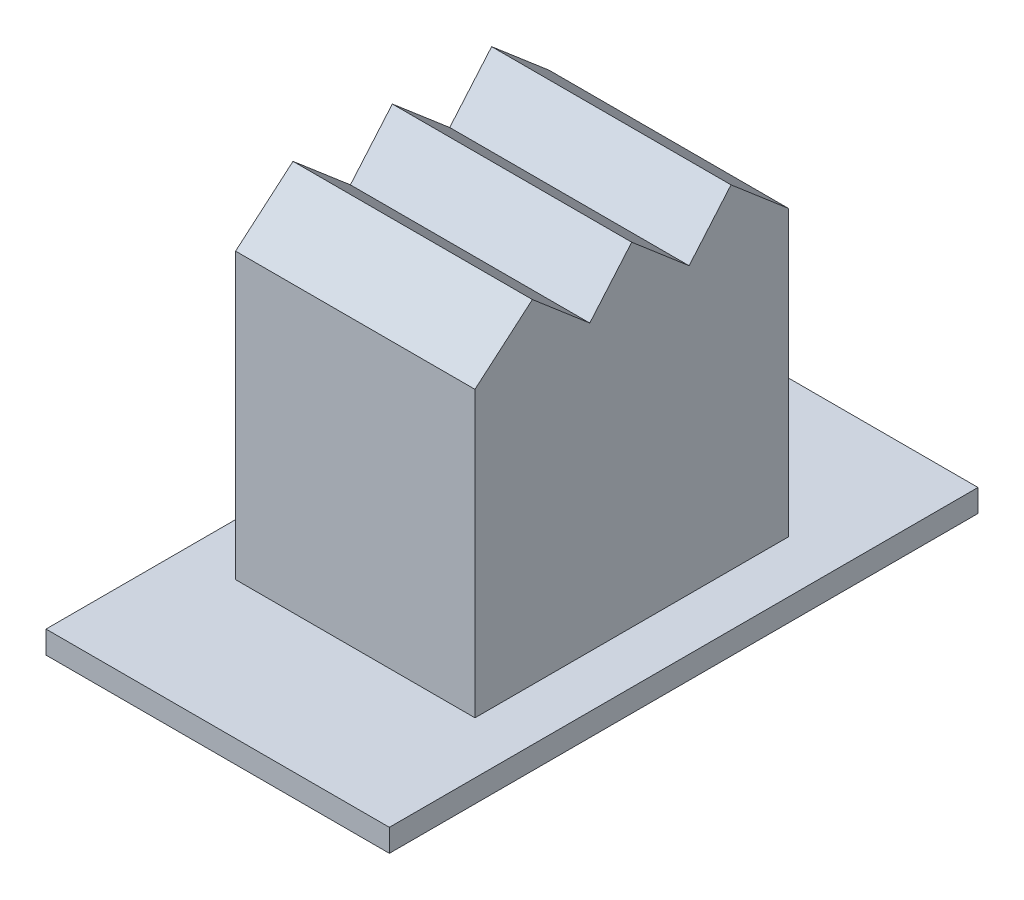
ISO-10303-21;
HEADER;
FILE_DESCRIPTION(('STEP AP214'),'2;1');
FILE_NAME('part.step','',(''),(''),'','','');
FILE_SCHEMA(('AUTOMOTIVE_DESIGN { 1 0 10303 214 1 1 1 1 }'));
ENDSEC;
DATA;
#1=APPLICATION_CONTEXT('core data for automotive mechanical design processes');
#2=APPLICATION_PROTOCOL_DEFINITION('international standard','automotive_design',2000,#1);
#3=PRODUCT_CONTEXT('',#1,'mechanical');
#4=PRODUCT('Part','Part','',(#3));
#5=PRODUCT_RELATED_PRODUCT_CATEGORY('part','',(#4));
#6=PRODUCT_DEFINITION_FORMATION('','',#4);
#7=PRODUCT_DEFINITION_CONTEXT('part definition',#1,'design');
#8=PRODUCT_DEFINITION('design','',#6,#7);
#9=PRODUCT_DEFINITION_SHAPE('','',#8);
#10=(LENGTH_UNIT() NAMED_UNIT(*) SI_UNIT(.MILLI.,.METRE.));
#11=(NAMED_UNIT(*) PLANE_ANGLE_UNIT() SI_UNIT($,.RADIAN.));
#12=(NAMED_UNIT(*) SI_UNIT($,.STERADIAN.) SOLID_ANGLE_UNIT());
#13=UNCERTAINTY_MEASURE_WITH_UNIT(LENGTH_MEASURE(1.E-05),#10,'distance_accuracy_value','');
#14=(GEOMETRIC_REPRESENTATION_CONTEXT(3) GLOBAL_UNCERTAINTY_ASSIGNED_CONTEXT((#13)) GLOBAL_UNIT_ASSIGNED_CONTEXT((#10,
#11,#12)) REPRESENTATION_CONTEXT('',''));
#15=CARTESIAN_POINT('',(0.,0.,0.));
#16=DIRECTION('',(0.,0.,1.));
#17=DIRECTION('',(1.,0.,0.));
#18=AXIS2_PLACEMENT_3D('',#15,#16,#17);
#19=CARTESIAN_POINT('',(0.,0.46,0.));
#20=DIRECTION('',(0.,-1.,0.));
#21=DIRECTION('',(0.,0.,-1.));
#22=AXIS2_PLACEMENT_3D('',#19,#20,#21);
#23=PLANE('',#22);
#24=DIRECTION('',(0.,0.,1.));
#25=VECTOR('',#24,1.);
#26=CARTESIAN_POINT('',(0.,0.46,0.));
#27=LINE('',#26,#25);
#28=CARTESIAN_POINT('',(0.,0.46,-12.));
#29=VERTEX_POINT('',#28);
#30=CARTESIAN_POINT('',(0.,0.46,0.));
#31=VERTEX_POINT('',#30);
#32=EDGE_CURVE('E246',#29,#31,#27,.T.);
#33=ORIENTED_EDGE('',*,*,#32,.T.);
#34=DIRECTION('',(1.,0.,0.));
#35=VECTOR('',#34,1.);
#36=CARTESIAN_POINT('',(0.,0.46,0.));
#37=LINE('',#36,#35);
#38=CARTESIAN_POINT('',(7.,0.46,0.));
#39=VERTEX_POINT('',#38);
#40=EDGE_CURVE('E249',#31,#39,#37,.T.);
#41=ORIENTED_EDGE('',*,*,#40,.T.);
#42=DIRECTION('',(0.,0.,-1.));
#43=VECTOR('',#42,1.);
#44=CARTESIAN_POINT('',(7.,0.46,0.));
#45=LINE('',#44,#43);
#46=CARTESIAN_POINT('',(7.,0.46,-12.));
#47=VERTEX_POINT('',#46);
#48=EDGE_CURVE('E252',#39,#47,#45,.T.);
#49=ORIENTED_EDGE('',*,*,#48,.T.);
#50=DIRECTION('',(-1.,0.,0.));
#51=VECTOR('',#50,1.);
#52=CARTESIAN_POINT('',(0.,0.46,-12.));
#53=LINE('',#52,#51);
#54=EDGE_CURVE('E254',#47,#29,#53,.T.);
#55=ORIENTED_EDGE('',*,*,#54,.T.);
#56=EDGE_LOOP('',(#33,#41,#49,#55));
#57=FACE_BOUND('',#56,.T.);
#58=DIRECTION('',(0.,0.,1.));
#59=VECTOR('',#58,1.);
#60=CARTESIAN_POINT('',(1.06,0.46,-2.805));
#61=LINE('',#60,#59);
#62=CARTESIAN_POINT('',(1.06,0.46,-9.195));
#63=VERTEX_POINT('',#62);
#64=CARTESIAN_POINT('',(1.06,0.46,-2.805));
#65=VERTEX_POINT('',#64);
#66=EDGE_CURVE('E208',#63,#65,#61,.T.);
#67=ORIENTED_EDGE('',*,*,#66,.F.);
#68=DIRECTION('',(-1.,0.,0.));
#69=VECTOR('',#68,1.);
#70=CARTESIAN_POINT('',(1.06,0.46,-9.195));
#71=LINE('',#70,#69);
#72=CARTESIAN_POINT('',(5.94,0.46,-9.195));
#73=VERTEX_POINT('',#72);
#74=EDGE_CURVE('E216',#73,#63,#71,.T.);
#75=ORIENTED_EDGE('',*,*,#74,.F.);
#76=DIRECTION('',(0.,0.,-1.));
#77=VECTOR('',#76,1.);
#78=CARTESIAN_POINT('',(5.94,0.46,-2.805));
#79=LINE('',#78,#77);
#80=CARTESIAN_POINT('',(5.94,0.46,-2.805));
#81=VERTEX_POINT('',#80);
#82=EDGE_CURVE('E213',#81,#73,#79,.T.);
#83=ORIENTED_EDGE('',*,*,#82,.F.);
#84=DIRECTION('',(1.,0.,0.));
#85=VECTOR('',#84,1.);
#86=CARTESIAN_POINT('',(1.06,0.46,-2.805));
#87=LINE('',#86,#85);
#88=EDGE_CURVE('E210',#65,#81,#87,.T.);
#89=ORIENTED_EDGE('',*,*,#88,.F.);
#90=EDGE_LOOP('',(#67,#75,#83,#89));
#91=FACE_BOUND('',#90,.T.);
#92=ADVANCED_FACE('F34',(#57,#91),#23,.F.);
#93=CARTESIAN_POINT('',(0.,0.,0.));
#94=DIRECTION('',(0.,-1.,0.));
#95=DIRECTION('',(0.,0.,-1.));
#96=AXIS2_PLACEMENT_3D('',#93,#94,#95);
#97=PLANE('',#96);
#98=DIRECTION('',(0.,0.,1.));
#99=VECTOR('',#98,1.);
#100=CARTESIAN_POINT('',(0.,0.,0.));
#101=LINE('',#100,#99);
#102=CARTESIAN_POINT('',(0.,0.,-12.));
#103=VERTEX_POINT('',#102);
#104=CARTESIAN_POINT('',(0.,0.,0.));
#105=VERTEX_POINT('',#104);
#106=EDGE_CURVE('E245',#103,#105,#101,.T.);
#107=ORIENTED_EDGE('',*,*,#106,.F.);
#108=DIRECTION('',(-1.,0.,0.));
#109=VECTOR('',#108,1.);
#110=CARTESIAN_POINT('',(0.,0.,-12.));
#111=LINE('',#110,#109);
#112=CARTESIAN_POINT('',(7.,0.,-12.));
#113=VERTEX_POINT('',#112);
#114=EDGE_CURVE('E250',#113,#103,#111,.T.);
#115=ORIENTED_EDGE('',*,*,#114,.F.);
#116=DIRECTION('',(0.,0.,-1.));
#117=VECTOR('',#116,1.);
#118=CARTESIAN_POINT('',(7.,0.,0.));
#119=LINE('',#118,#117);
#120=CARTESIAN_POINT('',(7.,0.,0.));
#121=VERTEX_POINT('',#120);
#122=EDGE_CURVE('E261',#121,#113,#119,.T.);
#123=ORIENTED_EDGE('',*,*,#122,.F.);
#124=DIRECTION('',(1.,0.,0.));
#125=VECTOR('',#124,1.);
#126=CARTESIAN_POINT('',(0.,0.,0.));
#127=LINE('',#126,#125);
#128=EDGE_CURVE('E259',#105,#121,#127,.T.);
#129=ORIENTED_EDGE('',*,*,#128,.F.);
#130=EDGE_LOOP('',(#107,#115,#123,#129));
#131=FACE_BOUND('',#130,.T.);
#132=DIRECTION('',(-1.,0.,0.));
#133=VECTOR('',#132,1.);
#134=CARTESIAN_POINT('',(2.27,0.,-7.185));
#135=LINE('',#134,#133);
#136=CARTESIAN_POINT('',(4.73,0.,-7.185));
#137=VERTEX_POINT('',#136);
#138=CARTESIAN_POINT('',(2.27,0.,-7.185));
#139=VERTEX_POINT('',#138);
#140=EDGE_CURVE('E232',#137,#139,#135,.T.);
#141=ORIENTED_EDGE('',*,*,#140,.T.);
#142=DIRECTION('',(0.,0.,1.));
#143=VECTOR('',#142,1.);
#144=CARTESIAN_POINT('',(2.27,0.,-4.815));
#145=LINE('',#144,#143);
#146=CARTESIAN_POINT('',(2.27,0.,-4.815));
#147=VERTEX_POINT('',#146);
#148=EDGE_CURVE('E223',#139,#147,#145,.T.);
#149=ORIENTED_EDGE('',*,*,#148,.T.);
#150=DIRECTION('',(1.,0.,0.));
#151=VECTOR('',#150,1.);
#152=CARTESIAN_POINT('',(2.27,0.,-4.815));
#153=LINE('',#152,#151);
#154=CARTESIAN_POINT('',(4.73,0.,-4.815));
#155=VERTEX_POINT('',#154);
#156=EDGE_CURVE('E226',#147,#155,#153,.T.);
#157=ORIENTED_EDGE('',*,*,#156,.T.);
#158=DIRECTION('',(0.,0.,-1.));
#159=VECTOR('',#158,1.);
#160=CARTESIAN_POINT('',(4.73,0.,-4.815));
#161=LINE('',#160,#159);
#162=EDGE_CURVE('E229',#155,#137,#161,.T.);
#163=ORIENTED_EDGE('',*,*,#162,.T.);
#164=EDGE_LOOP('',(#141,#149,#157,#163));
#165=FACE_BOUND('',#164,.T.);
#166=ADVANCED_FACE('F320',(#131,#165),#97,.T.);
#167=CARTESIAN_POINT('',(0.,0.46,0.));
#168=DIRECTION('',(1.,0.,0.));
#169=DIRECTION('',(0.,0.,-1.));
#170=AXIS2_PLACEMENT_3D('',#167,#168,#169);
#171=PLANE('',#170);
#172=ORIENTED_EDGE('',*,*,#106,.T.);
#173=DIRECTION('',(0.,-1.,0.));
#174=VECTOR('',#173,1.);
#175=CARTESIAN_POINT('',(0.,0.46,0.));
#176=LINE('',#175,#174);
#177=EDGE_CURVE('E165',#31,#105,#176,.T.);
#178=ORIENTED_EDGE('',*,*,#177,.F.);
#179=ORIENTED_EDGE('',*,*,#32,.F.);
#180=DIRECTION('',(0.,-1.,0.));
#181=VECTOR('',#180,1.);
#182=CARTESIAN_POINT('',(0.,0.46,-12.));
#183=LINE('',#182,#181);
#184=EDGE_CURVE('E256',#29,#103,#183,.T.);
#185=ORIENTED_EDGE('',*,*,#184,.T.);
#186=EDGE_LOOP('',(#172,#178,#179,#185));
#187=FACE_BOUND('',#186,.T.);
#188=ADVANCED_FACE('F36',(#187),#171,.F.);
#189=CARTESIAN_POINT('',(0.,0.46,0.));
#190=DIRECTION('',(0.,0.,-1.));
#191=DIRECTION('',(-1.,0.,0.));
#192=AXIS2_PLACEMENT_3D('',#189,#190,#191);
#193=PLANE('',#192);
#194=ORIENTED_EDGE('',*,*,#128,.T.);
#195=DIRECTION('',(0.,-1.,0.));
#196=VECTOR('',#195,1.);
#197=CARTESIAN_POINT('',(7.,0.46,0.));
#198=LINE('',#197,#196);
#199=EDGE_CURVE('E269',#39,#121,#198,.T.);
#200=ORIENTED_EDGE('',*,*,#199,.F.);
#201=ORIENTED_EDGE('',*,*,#40,.F.);
#202=ORIENTED_EDGE('',*,*,#177,.T.);
#203=EDGE_LOOP('',(#194,#200,#201,#202));
#204=FACE_BOUND('',#203,.T.);
#205=ADVANCED_FACE('F338',(#204),#193,.F.);
#206=CARTESIAN_POINT('',(7.,0.46,0.));
#207=DIRECTION('',(-1.,0.,0.));
#208=DIRECTION('',(0.,0.,1.));
#209=AXIS2_PLACEMENT_3D('',#206,#207,#208);
#210=PLANE('',#209);
#211=ORIENTED_EDGE('',*,*,#122,.T.);
#212=DIRECTION('',(0.,-1.,0.));
#213=VECTOR('',#212,1.);
#214=CARTESIAN_POINT('',(7.,0.46,-12.));
#215=LINE('',#214,#213);
#216=EDGE_CURVE('E266',#47,#113,#215,.T.);
#217=ORIENTED_EDGE('',*,*,#216,.F.);
#218=ORIENTED_EDGE('',*,*,#48,.F.);
#219=ORIENTED_EDGE('',*,*,#199,.T.);
#220=EDGE_LOOP('',(#211,#217,#218,#219));
#221=FACE_BOUND('',#220,.T.);
#222=ADVANCED_FACE('F335',(#221),#210,.F.);
#223=CARTESIAN_POINT('',(0.,0.46,-12.));
#224=DIRECTION('',(0.,0.,1.));
#225=DIRECTION('',(1.,0.,0.));
#226=AXIS2_PLACEMENT_3D('',#223,#224,#225);
#227=PLANE('',#226);
#228=ORIENTED_EDGE('',*,*,#114,.T.);
#229=ORIENTED_EDGE('',*,*,#184,.F.);
#230=ORIENTED_EDGE('',*,*,#54,.F.);
#231=ORIENTED_EDGE('',*,*,#216,.T.);
#232=EDGE_LOOP('',(#228,#229,#230,#231));
#233=FACE_BOUND('',#232,.T.);
#234=ADVANCED_FACE('F332',(#233),#227,.F.);
#235=CARTESIAN_POINT('',(2.27,0.46,-4.815));
#236=DIRECTION('',(1.,0.,0.));
#237=DIRECTION('',(0.,0.,-1.));
#238=AXIS2_PLACEMENT_3D('',#235,#236,#237);
#239=PLANE('',#238);
#240=ORIENTED_EDGE('',*,*,#148,.F.);
#241=DIRECTION('',(0.,-1.,0.));
#242=VECTOR('',#241,1.);
#243=CARTESIAN_POINT('',(2.27,0.46,-7.185));
#244=LINE('',#243,#242);
#245=CARTESIAN_POINT('',(2.27,4.46,-7.185));
#246=VERTEX_POINT('',#245);
#247=EDGE_CURVE('E235',#246,#139,#244,.T.);
#248=ORIENTED_EDGE('',*,*,#247,.F.);
#249=DIRECTION('',(0.,0.,1.));
#250=VECTOR('',#249,1.);
#251=CARTESIAN_POINT('',(2.27,4.46,-7.185));
#252=LINE('',#251,#250);
#253=CARTESIAN_POINT('',(2.27,4.46,-4.815));
#254=VERTEX_POINT('',#253);
#255=EDGE_CURVE('E196',#246,#254,#252,.T.);
#256=ORIENTED_EDGE('',*,*,#255,.T.);
#257=DIRECTION('',(0.,-1.,0.));
#258=VECTOR('',#257,1.);
#259=CARTESIAN_POINT('',(2.27,0.46,-4.815));
#260=LINE('',#259,#258);
#261=EDGE_CURVE('E242',#254,#147,#260,.T.);
#262=ORIENTED_EDGE('',*,*,#261,.T.);
#263=EDGE_LOOP('',(#240,#248,#256,#262));
#264=FACE_BOUND('',#263,.T.);
#265=ADVANCED_FACE('F329',(#264),#239,.T.);
#266=CARTESIAN_POINT('',(2.27,0.46,-4.815));
#267=DIRECTION('',(0.,0.,-1.));
#268=DIRECTION('',(-1.,0.,0.));
#269=AXIS2_PLACEMENT_3D('',#266,#267,#268);
#270=PLANE('',#269);
#271=ORIENTED_EDGE('',*,*,#156,.F.);
#272=ORIENTED_EDGE('',*,*,#261,.F.);
#273=DIRECTION('',(1.,0.,0.));
#274=VECTOR('',#273,1.);
#275=CARTESIAN_POINT('',(2.27,4.46,-4.815));
#276=LINE('',#275,#274);
#277=CARTESIAN_POINT('',(4.73,4.46,-4.815));
#278=VERTEX_POINT('',#277);
#279=EDGE_CURVE('E199',#254,#278,#276,.T.);
#280=ORIENTED_EDGE('',*,*,#279,.T.);
#281=DIRECTION('',(0.,-1.,0.));
#282=VECTOR('',#281,1.);
#283=CARTESIAN_POINT('',(4.73,0.46,-4.815));
#284=LINE('',#283,#282);
#285=EDGE_CURVE('E240',#278,#155,#284,.T.);
#286=ORIENTED_EDGE('',*,*,#285,.T.);
#287=EDGE_LOOP('',(#271,#272,#280,#286));
#288=FACE_BOUND('',#287,.T.);
#289=ADVANCED_FACE('F365',(#288),#270,.T.);
#290=CARTESIAN_POINT('',(4.73,0.46,-4.815));
#291=DIRECTION('',(-1.,0.,0.));
#292=DIRECTION('',(0.,0.,1.));
#293=AXIS2_PLACEMENT_3D('',#290,#291,#292);
#294=PLANE('',#293);
#295=ORIENTED_EDGE('',*,*,#162,.F.);
#296=ORIENTED_EDGE('',*,*,#285,.F.);
#297=DIRECTION('',(0.,0.,-1.));
#298=VECTOR('',#297,1.);
#299=CARTESIAN_POINT('',(4.73,4.46,-7.185));
#300=LINE('',#299,#298);
#301=CARTESIAN_POINT('',(4.73,4.46,-7.185));
#302=VERTEX_POINT('',#301);
#303=EDGE_CURVE('E202',#278,#302,#300,.T.);
#304=ORIENTED_EDGE('',*,*,#303,.T.);
#305=DIRECTION('',(0.,-1.,0.));
#306=VECTOR('',#305,1.);
#307=CARTESIAN_POINT('',(4.73,0.46,-7.185));
#308=LINE('',#307,#306);
#309=EDGE_CURVE('E238',#302,#137,#308,.T.);
#310=ORIENTED_EDGE('',*,*,#309,.T.);
#311=EDGE_LOOP('',(#295,#296,#304,#310));
#312=FACE_BOUND('',#311,.T.);
#313=ADVANCED_FACE('F368',(#312),#294,.T.);
#314=CARTESIAN_POINT('',(2.27,0.46,-7.185));
#315=DIRECTION('',(0.,0.,1.));
#316=DIRECTION('',(1.,0.,0.));
#317=AXIS2_PLACEMENT_3D('',#314,#315,#316);
#318=PLANE('',#317);
#319=ORIENTED_EDGE('',*,*,#140,.F.);
#320=ORIENTED_EDGE('',*,*,#309,.F.);
#321=DIRECTION('',(-1.,0.,0.));
#322=VECTOR('',#321,1.);
#323=CARTESIAN_POINT('',(2.27,4.46,-7.185));
#324=LINE('',#323,#322);
#325=EDGE_CURVE('E205',#302,#246,#324,.T.);
#326=ORIENTED_EDGE('',*,*,#325,.T.);
#327=ORIENTED_EDGE('',*,*,#247,.T.);
#328=EDGE_LOOP('',(#319,#320,#326,#327));
#329=FACE_BOUND('',#328,.T.);
#330=ADVANCED_FACE('F317',(#329),#318,.T.);
#331=CARTESIAN_POINT('',(1.06,4.46,-2.805));
#332=DIRECTION('',(1.,0.,0.));
#333=DIRECTION('',(0.,0.,-1.));
#334=AXIS2_PLACEMENT_3D('',#331,#332,#333);
#335=PLANE('',#334);
#336=DIRECTION('',(0.,-1.,0.));
#337=VECTOR('',#336,1.);
#338=CARTESIAN_POINT('',(1.06,4.46,-2.805));
#339=LINE('',#338,#337);
#340=CARTESIAN_POINT('',(1.06,6.26,-2.805));
#341=VERTEX_POINT('',#340);
#342=EDGE_CURVE('E172',#341,#65,#339,.T.);
#343=ORIENTED_EDGE('',*,*,#342,.F.);
#344=DIRECTION('',(0.,-0.649644996271411,0.760237712047698));
#345=VECTOR('',#344,1.);
#346=CARTESIAN_POINT('',(1.06,2.23269185657802,1.90789942389866));
#347=LINE('',#346,#345);
#348=CARTESIAN_POINT('',(1.06,7.26,-3.97523561546848));
#349=VERTEX_POINT('',#348);
#350=EDGE_CURVE('E158',#349,#341,#347,.T.);
#351=ORIENTED_EDGE('',*,*,#350,.F.);
#352=DIRECTION('',(0.,0.649644996271411,0.760237712047698));
#353=VECTOR('',#352,1.);
#354=CARTESIAN_POINT('',(1.06,6.15930736388138,-5.26330533993839));
#355=LINE('',#354,#353);
#356=CARTESIAN_POINT('',(1.06,6.26,-5.14547123093697));
#357=VERTEX_POINT('',#356);
#358=EDGE_CURVE('E171',#357,#349,#355,.T.);
#359=ORIENTED_EDGE('',*,*,#358,.F.);
#360=DIRECTION('',(0.,-0.760237712047698,0.649644996271411));
#361=VECTOR('',#360,1.);
#362=CARTESIAN_POINT('',(1.06,0.100692636118622,0.11783410900142));
#363=LINE('',#362,#361);
#364=CARTESIAN_POINT('',(1.06,7.26,-6.));
#365=VERTEX_POINT('',#364);
#366=EDGE_CURVE('E179',#365,#357,#363,.T.);
#367=ORIENTED_EDGE('',*,*,#366,.F.);
#368=DIRECTION('',(0.,0.649644996271412,0.760237712047697));
#369=VECTOR('',#368,1.);
#370=CARTESIAN_POINT('',(1.06,7.15930736388137,-6.11783410900142));
#371=LINE('',#370,#369);
#372=CARTESIAN_POINT('',(1.06,6.26,-7.17023561546849));
#373=VERTEX_POINT('',#372);
#374=EDGE_CURVE('E279',#373,#365,#371,.T.);
#375=ORIENTED_EDGE('',*,*,#374,.F.);
#376=DIRECTION('',(0.,-0.760237712047697,0.649644996271412));
#377=VECTOR('',#376,1.);
#378=CARTESIAN_POINT('',(1.06,-0.899307363881372,-1.05240150646706));
#379=LINE('',#378,#377);
#380=CARTESIAN_POINT('',(1.06,7.26,-8.02476438453151));
#381=VERTEX_POINT('',#380);
#382=EDGE_CURVE('E290',#381,#373,#379,.T.);
#383=ORIENTED_EDGE('',*,*,#382,.F.);
#384=DIRECTION('',(0.,0.649644996271412,0.760237712047697));
#385=VECTOR('',#384,1.);
#386=CARTESIAN_POINT('',(1.06,8.15930736388137,-6.97236287806445));
#387=LINE('',#386,#385);
#388=CARTESIAN_POINT('',(1.06,6.26,-9.195));
#389=VERTEX_POINT('',#388);
#390=EDGE_CURVE('E181',#389,#381,#387,.T.);
#391=ORIENTED_EDGE('',*,*,#390,.F.);
#392=DIRECTION('',(0.,-1.,0.));
#393=VECTOR('',#392,1.);
#394=CARTESIAN_POINT('',(1.06,4.46,-9.195));
#395=LINE('',#394,#393);
#396=EDGE_CURVE('E49',#389,#63,#395,.T.);
#397=ORIENTED_EDGE('',*,*,#396,.T.);
#398=ORIENTED_EDGE('',*,*,#66,.T.);
#399=EDGE_LOOP('',(#343,#351,#359,#367,#375,#383,#391,#397,#398));
#400=FACE_BOUND('',#399,.T.);
#401=ADVANCED_FACE('F169',(#400),#335,.F.);
#402=CARTESIAN_POINT('',(1.06,4.46,-2.805));
#403=DIRECTION('',(0.,0.,-1.));
#404=DIRECTION('',(-1.,0.,0.));
#405=AXIS2_PLACEMENT_3D('',#402,#403,#404);
#406=PLANE('',#405);
#407=DIRECTION('',(0.,-1.,0.));
#408=VECTOR('',#407,1.);
#409=CARTESIAN_POINT('',(5.94,4.46,-2.805));
#410=LINE('',#409,#408);
#411=CARTESIAN_POINT('',(5.94,6.26,-2.805));
#412=VERTEX_POINT('',#411);
#413=EDGE_CURVE('E220',#412,#81,#410,.T.);
#414=ORIENTED_EDGE('',*,*,#413,.F.);
#415=DIRECTION('',(-1.,0.,0.));
#416=VECTOR('',#415,1.);
#417=CARTESIAN_POINT('',(11.06,6.26,-2.805));
#418=LINE('',#417,#416);
#419=EDGE_CURVE('E173',#412,#341,#418,.T.);
#420=ORIENTED_EDGE('',*,*,#419,.T.);
#421=ORIENTED_EDGE('',*,*,#342,.T.);
#422=ORIENTED_EDGE('',*,*,#88,.T.);
#423=EDGE_LOOP('',(#414,#420,#421,#422));
#424=FACE_BOUND('',#423,.T.);
#425=ADVANCED_FACE('F308',(#424),#406,.F.);
#426=CARTESIAN_POINT('',(5.94,4.46,-2.805));
#427=DIRECTION('',(-1.,0.,0.));
#428=DIRECTION('',(0.,0.,1.));
#429=AXIS2_PLACEMENT_3D('',#426,#427,#428);
#430=PLANE('',#429);
#431=DIRECTION('',(0.,0.649644996271411,0.760237712047698));
#432=VECTOR('',#431,1.);
#433=CARTESIAN_POINT('',(5.94,6.65625323951417,-4.68176157731273));
#434=LINE('',#433,#432);
#435=CARTESIAN_POINT('',(5.94,6.26,-5.14547123093697));
#436=VERTEX_POINT('',#435);
#437=CARTESIAN_POINT('',(5.94,7.26,-3.97523561546848));
#438=VERTEX_POINT('',#437);
#439=EDGE_CURVE('E187',#436,#438,#434,.T.);
#440=ORIENTED_EDGE('',*,*,#439,.T.);
#441=DIRECTION('',(0.,-0.649644996271411,0.760237712047698));
#442=VECTOR('',#441,1.);
#443=CARTESIAN_POINT('',(5.94,5.50033048187513,-1.9160076739045));
#444=LINE('',#443,#442);
#445=EDGE_CURVE('E161',#438,#412,#444,.T.);
#446=ORIENTED_EDGE('',*,*,#445,.T.);
#447=ORIENTED_EDGE('',*,*,#413,.T.);
#448=ORIENTED_EDGE('',*,*,#82,.T.);
#449=DIRECTION('',(0.,-1.,0.));
#450=VECTOR('',#449,1.);
#451=CARTESIAN_POINT('',(5.94,4.46,-9.195));
#452=LINE('',#451,#450);
#453=CARTESIAN_POINT('',(5.94,6.26,-9.195));
#454=VERTEX_POINT('',#453);
#455=EDGE_CURVE('E57',#454,#73,#452,.T.);
#456=ORIENTED_EDGE('',*,*,#455,.F.);
#457=DIRECTION('',(0.,0.649644996271412,0.760237712047697));
#458=VECTOR('',#457,1.);
#459=CARTESIAN_POINT('',(5.94,8.65625323951417,-6.39081911543879));
#460=LINE('',#459,#458);
#461=CARTESIAN_POINT('',(5.94,7.26,-8.02476438453151));
#462=VERTEX_POINT('',#461);
#463=EDGE_CURVE('E193',#454,#462,#460,.T.);
#464=ORIENTED_EDGE('',*,*,#463,.T.);
#465=DIRECTION('',(0.,-0.760237712047697,0.649644996271412));
#466=VECTOR('',#465,1.);
#467=CARTESIAN_POINT('',(5.94,3.06374676048583,-4.43894526909273));
#468=LINE('',#467,#466);
#469=CARTESIAN_POINT('',(5.94,6.26,-7.17023561546849));
#470=VERTEX_POINT('',#469);
#471=EDGE_CURVE('E285',#462,#470,#468,.T.);
#472=ORIENTED_EDGE('',*,*,#471,.T.);
#473=DIRECTION('',(0.,0.649644996271412,0.760237712047697));
#474=VECTOR('',#473,1.);
#475=CARTESIAN_POINT('',(5.94,7.65625323951417,-5.53629034637576));
#476=LINE('',#475,#474);
#477=CARTESIAN_POINT('',(5.94,7.26,-6.));
#478=VERTEX_POINT('',#477);
#479=EDGE_CURVE('E183',#470,#478,#476,.T.);
#480=ORIENTED_EDGE('',*,*,#479,.T.);
#481=DIRECTION('',(0.,-0.760237712047698,0.649644996271411));
#482=VECTOR('',#481,1.);
#483=CARTESIAN_POINT('',(5.94,4.06374676048583,-3.26870965362424));
#484=LINE('',#483,#482);
#485=EDGE_CURVE('E189',#478,#436,#484,.T.);
#486=ORIENTED_EDGE('',*,*,#485,.T.);
#487=EDGE_LOOP('',(#440,#446,#447,#448,#456,#464,#472,#480,#486));
#488=FACE_BOUND('',#487,.T.);
#489=ADVANCED_FACE('F284',(#488),#430,.F.);
#490=CARTESIAN_POINT('',(1.06,4.46,-9.195));
#491=DIRECTION('',(0.,0.,1.));
#492=DIRECTION('',(1.,0.,0.));
#493=AXIS2_PLACEMENT_3D('',#490,#491,#492);
#494=PLANE('',#493);
#495=ORIENTED_EDGE('',*,*,#396,.F.);
#496=DIRECTION('',(-1.,0.,0.));
#497=VECTOR('',#496,1.);
#498=CARTESIAN_POINT('',(11.06,6.26,-9.195));
#499=LINE('',#498,#497);
#500=EDGE_CURVE('E190',#454,#389,#499,.T.);
#501=ORIENTED_EDGE('',*,*,#500,.F.);
#502=ORIENTED_EDGE('',*,*,#455,.T.);
#503=ORIENTED_EDGE('',*,*,#74,.T.);
#504=EDGE_LOOP('',(#495,#501,#502,#503));
#505=FACE_BOUND('',#504,.T.);
#506=ADVANCED_FACE('F302',(#505),#494,.F.);
#507=CARTESIAN_POINT('',(0.,4.46,0.));
#508=DIRECTION('',(0.,-1.,0.));
#509=DIRECTION('',(0.,0.,-1.));
#510=AXIS2_PLACEMENT_3D('',#507,#508,#509);
#511=PLANE('',#510);
#512=ORIENTED_EDGE('',*,*,#255,.F.);
#513=ORIENTED_EDGE('',*,*,#325,.F.);
#514=ORIENTED_EDGE('',*,*,#303,.F.);
#515=ORIENTED_EDGE('',*,*,#279,.F.);
#516=EDGE_LOOP('',(#512,#513,#514,#515));
#517=FACE_BOUND('',#516,.T.);
#518=ADVANCED_FACE('F370',(#517),#511,.T.);
#519=CARTESIAN_POINT('',(11.06,0.100692636118622,0.11783410900142));
#520=DIRECTION('',(0.,-0.649644996271411,-0.760237712047698));
#521=DIRECTION('',(0.,0.760237712047698,-0.649644996271411));
#522=AXIS2_PLACEMENT_3D('',#519,#520,#521);
#523=PLANE('',#522);
#524=DIRECTION('',(1.,0.,0.));
#525=VECTOR('',#524,1.);
#526=CARTESIAN_POINT('',(0.,7.26,-6.));
#527=LINE('',#526,#525);
#528=EDGE_CURVE('E42',#365,#478,#527,.T.);
#529=ORIENTED_EDGE('',*,*,#528,.F.);
#530=ORIENTED_EDGE('',*,*,#366,.T.);
#531=DIRECTION('',(-1.,0.,0.));
#532=VECTOR('',#531,1.);
#533=CARTESIAN_POINT('',(11.06,6.26,-5.14547123093697));
#534=LINE('',#533,#532);
#535=EDGE_CURVE('E177',#436,#357,#534,.T.);
#536=ORIENTED_EDGE('',*,*,#535,.F.);
#537=ORIENTED_EDGE('',*,*,#485,.F.);
#538=EDGE_LOOP('',(#529,#530,#536,#537));
#539=FACE_BOUND('',#538,.T.);
#540=ADVANCED_FACE('F287',(#539),#523,.F.);
#541=CARTESIAN_POINT('',(11.06,6.15930736388138,-5.26330533993839));
#542=DIRECTION('',(0.,-0.760237712047698,0.649644996271411));
#543=DIRECTION('',(0.,-0.649644996271411,-0.760237712047698));
#544=AXIS2_PLACEMENT_3D('',#541,#542,#543);
#545=PLANE('',#544);
#546=ORIENTED_EDGE('',*,*,#535,.T.);
#547=ORIENTED_EDGE('',*,*,#358,.T.);
#548=DIRECTION('',(-1.,0.,0.));
#549=VECTOR('',#548,1.);
#550=CARTESIAN_POINT('',(0.,7.26,-3.97523561546849));
#551=LINE('',#550,#549);
#552=EDGE_CURVE('E155',#438,#349,#551,.T.);
#553=ORIENTED_EDGE('',*,*,#552,.F.);
#554=ORIENTED_EDGE('',*,*,#439,.F.);
#555=EDGE_LOOP('',(#546,#547,#553,#554));
#556=FACE_BOUND('',#555,.T.);
#557=ADVANCED_FACE('F175',(#556),#545,.F.);
#558=CARTESIAN_POINT('',(11.06,8.15930736388137,-6.97236287806445));
#559=DIRECTION('',(0.,-0.760237712047697,0.649644996271412));
#560=DIRECTION('',(0.,-0.649644996271412,-0.760237712047697));
#561=AXIS2_PLACEMENT_3D('',#558,#559,#560);
#562=PLANE('',#561);
#563=ORIENTED_EDGE('',*,*,#500,.T.);
#564=ORIENTED_EDGE('',*,*,#390,.T.);
#565=DIRECTION('',(-1.,0.,0.));
#566=VECTOR('',#565,1.);
#567=CARTESIAN_POINT('',(0.,7.26,-8.02476438453152));
#568=LINE('',#567,#566);
#569=EDGE_CURVE('E12',#462,#381,#568,.T.);
#570=ORIENTED_EDGE('',*,*,#569,.F.);
#571=ORIENTED_EDGE('',*,*,#463,.F.);
#572=EDGE_LOOP('',(#563,#564,#570,#571));
#573=FACE_BOUND('',#572,.T.);
#574=ADVANCED_FACE('F300',(#573),#562,.F.);
#575=CARTESIAN_POINT('',(11.06,7.15930736388137,-6.11783410900142));
#576=DIRECTION('',(0.,-0.760237712047697,0.649644996271412));
#577=DIRECTION('',(0.,-0.649644996271412,-0.760237712047697));
#578=AXIS2_PLACEMENT_3D('',#575,#576,#577);
#579=PLANE('',#578);
#580=DIRECTION('',(-1.,0.,0.));
#581=VECTOR('',#580,1.);
#582=CARTESIAN_POINT('',(11.06,6.26,-7.17023561546849));
#583=LINE('',#582,#581);
#584=EDGE_CURVE('E292',#470,#373,#583,.T.);
#585=ORIENTED_EDGE('',*,*,#584,.T.);
#586=ORIENTED_EDGE('',*,*,#374,.T.);
#587=ORIENTED_EDGE('',*,*,#528,.T.);
#588=ORIENTED_EDGE('',*,*,#479,.F.);
#589=EDGE_LOOP('',(#585,#586,#587,#588));
#590=FACE_BOUND('',#589,.T.);
#591=ADVANCED_FACE('F276',(#590),#579,.F.);
#592=CARTESIAN_POINT('',(11.06,-0.899307363881372,-1.05240150646706));
#593=DIRECTION('',(0.,-0.649644996271412,-0.760237712047697));
#594=DIRECTION('',(0.,0.760237712047697,-0.649644996271412));
#595=AXIS2_PLACEMENT_3D('',#592,#593,#594);
#596=PLANE('',#595);
#597=ORIENTED_EDGE('',*,*,#569,.T.);
#598=ORIENTED_EDGE('',*,*,#382,.T.);
#599=ORIENTED_EDGE('',*,*,#584,.F.);
#600=ORIENTED_EDGE('',*,*,#471,.F.);
#601=EDGE_LOOP('',(#597,#598,#599,#600));
#602=FACE_BOUND('',#601,.T.);
#603=ADVANCED_FACE('F384',(#602),#596,.F.);
#604=CARTESIAN_POINT('',(11.06,2.23269185657802,1.90789942389866));
#605=DIRECTION('',(0.,-0.760237712047698,-0.649644996271411));
#606=DIRECTION('',(0.,0.649644996271411,-0.760237712047698));
#607=AXIS2_PLACEMENT_3D('',#604,#605,#606);
#608=PLANE('',#607);
#609=ORIENTED_EDGE('',*,*,#552,.T.);
#610=ORIENTED_EDGE('',*,*,#350,.T.);
#611=ORIENTED_EDGE('',*,*,#419,.F.);
#612=ORIENTED_EDGE('',*,*,#445,.F.);
#613=EDGE_LOOP('',(#609,#610,#611,#612));
#614=FACE_BOUND('',#613,.T.);
#615=ADVANCED_FACE('F157',(#614),#608,.F.);
#616=CLOSED_SHELL('',(#92,#166,#188,#205,#222,#234,#265,#289,#313,#330,#401,#425,#489,#506,#518,
#540,#557,#574,#591,#603,#615));
#617=MANIFOLD_SOLID_BREP('B2',#616);
#618=ADVANCED_BREP_SHAPE_REPRESENTATION('',(#18,#617),#14);
#619=SHAPE_DEFINITION_REPRESENTATION(#9,#618);
ENDSEC;
END-ISO-10303-21;
